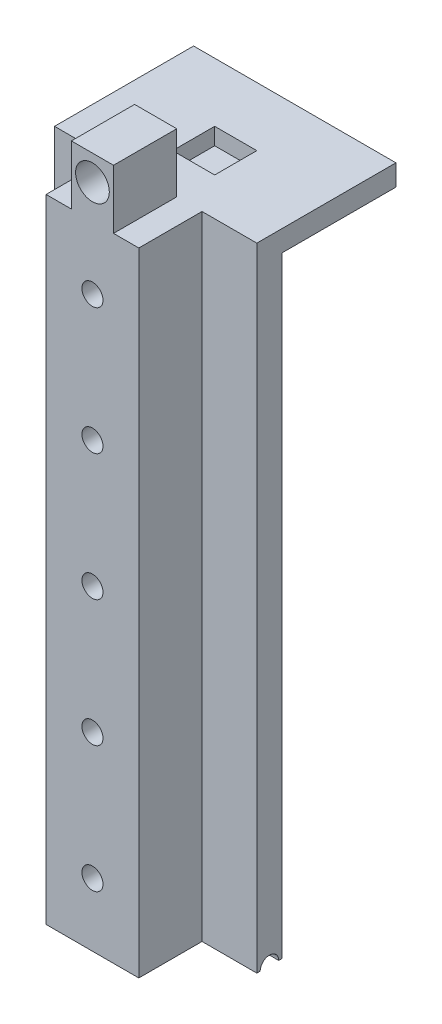
ISO-10303-21;
HEADER;
FILE_DESCRIPTION(('STEP AP214'),'2;1');
FILE_NAME('part.step','',(''),(''),'','','');
FILE_SCHEMA(('AUTOMOTIVE_DESIGN { 1 0 10303 214 1 1 1 1 }'));
ENDSEC;
DATA;
#1=APPLICATION_CONTEXT('core data for automotive mechanical design processes');
#2=APPLICATION_PROTOCOL_DEFINITION('international standard','automotive_design',2000,#1);
#3=PRODUCT_CONTEXT('',#1,'mechanical');
#4=PRODUCT('Part','Part','',(#3));
#5=PRODUCT_RELATED_PRODUCT_CATEGORY('part','',(#4));
#6=PRODUCT_DEFINITION_FORMATION('','',#4);
#7=PRODUCT_DEFINITION_CONTEXT('part definition',#1,'design');
#8=PRODUCT_DEFINITION('design','',#6,#7);
#9=PRODUCT_DEFINITION_SHAPE('','',#8);
#10=(LENGTH_UNIT() NAMED_UNIT(*) SI_UNIT(.MILLI.,.METRE.));
#11=(NAMED_UNIT(*) PLANE_ANGLE_UNIT() SI_UNIT($,.RADIAN.));
#12=(NAMED_UNIT(*) SI_UNIT($,.STERADIAN.) SOLID_ANGLE_UNIT());
#13=UNCERTAINTY_MEASURE_WITH_UNIT(LENGTH_MEASURE(1.E-05),#10,'distance_accuracy_value','');
#14=(GEOMETRIC_REPRESENTATION_CONTEXT(3) GLOBAL_UNCERTAINTY_ASSIGNED_CONTEXT((#13)) GLOBAL_UNIT_ASSIGNED_CONTEXT((#10,
#11,#12)) REPRESENTATION_CONTEXT('',''));
#15=CARTESIAN_POINT('',(0.,0.,0.));
#16=DIRECTION('',(0.,0.,1.));
#17=DIRECTION('',(1.,0.,0.));
#18=AXIS2_PLACEMENT_3D('',#15,#16,#17);
#19=CARTESIAN_POINT('',(11.6229500392828,23.9397751900583,3.));
#20=DIRECTION('',(0.,-1.,0.));
#21=DIRECTION('',(0.,0.,-1.));
#22=AXIS2_PLACEMENT_3D('',#19,#20,#21);
#23=PLANE('',#22);
#24=DIRECTION('',(-1.,0.,0.));
#25=VECTOR('',#24,1.);
#26=CARTESIAN_POINT('',(26.1229500392828,23.9397751900583,-6.5));
#27=LINE('',#26,#25);
#28=CARTESIAN_POINT('',(26.1229500392828,23.9397751900583,-6.5));
#29=VERTEX_POINT('',#28);
#30=CARTESIAN_POINT('',(21.1229500392828,23.9397751900583,-6.5));
#31=VERTEX_POINT('',#30);
#32=EDGE_CURVE('E246',#29,#31,#27,.T.);
#33=ORIENTED_EDGE('',*,*,#32,.F.);
#34=DIRECTION('',(0.,0.,-1.));
#35=VECTOR('',#34,1.);
#36=CARTESIAN_POINT('',(26.1229500392828,23.9397751900583,-1.5));
#37=LINE('',#36,#35);
#38=CARTESIAN_POINT('',(26.1229500392828,23.9397751900583,-1.5));
#39=VERTEX_POINT('',#38);
#40=EDGE_CURVE('E59',#39,#29,#37,.T.);
#41=ORIENTED_EDGE('',*,*,#40,.F.);
#42=DIRECTION('',(1.,0.,0.));
#43=VECTOR('',#42,1.);
#44=CARTESIAN_POINT('',(26.1229500392828,23.9397751900583,-1.5));
#45=LINE('',#44,#43);
#46=CARTESIAN_POINT('',(21.1229500392828,23.9397751900583,-1.5));
#47=VERTEX_POINT('',#46);
#48=EDGE_CURVE('E237',#47,#39,#45,.T.);
#49=ORIENTED_EDGE('',*,*,#48,.F.);
#50=DIRECTION('',(0.,0.,1.));
#51=VECTOR('',#50,1.);
#52=CARTESIAN_POINT('',(21.1229500392828,23.9397751900583,-1.5));
#53=LINE('',#52,#51);
#54=EDGE_CURVE('E240',#31,#47,#53,.T.);
#55=ORIENTED_EDGE('',*,*,#54,.F.);
#56=EDGE_LOOP('',(#33,#41,#49,#55));
#57=FACE_BOUND('',#56,.T.);
#58=DIRECTION('',(0.,0.,-1.));
#59=VECTOR('',#58,1.);
#60=CARTESIAN_POINT('',(26.1229500392828,23.9397751900583,10.5));
#61=LINE('',#60,#59);
#62=CARTESIAN_POINT('',(26.1229500392828,23.9397751900583,10.5));
#63=VERTEX_POINT('',#62);
#64=CARTESIAN_POINT('',(26.1229500392828,23.9397751900583,3.));
#65=VERTEX_POINT('',#64);
#66=EDGE_CURVE('E259',#63,#65,#61,.T.);
#67=ORIENTED_EDGE('',*,*,#66,.F.);
#68=DIRECTION('',(1.,0.,0.));
#69=VECTOR('',#68,1.);
#70=CARTESIAN_POINT('',(18.1229500392828,23.9397751900583,10.5));
#71=LINE('',#70,#69);
#72=CARTESIAN_POINT('',(29.1229500392828,23.9397751900583,10.5));
#73=VERTEX_POINT('',#72);
#74=EDGE_CURVE('E386',#63,#73,#71,.T.);
#75=ORIENTED_EDGE('',*,*,#74,.T.);
#76=DIRECTION('',(0.,0.,-1.));
#77=VECTOR('',#76,1.);
#78=CARTESIAN_POINT('',(29.1229500392828,23.9397751900583,10.5));
#79=LINE('',#78,#77);
#80=CARTESIAN_POINT('',(29.1229500392829,23.9397751900583,3.));
#81=VERTEX_POINT('',#80);
#82=EDGE_CURVE('E385',#73,#81,#79,.T.);
#83=ORIENTED_EDGE('',*,*,#82,.T.);
#84=DIRECTION('',(-1.,0.,0.));
#85=VECTOR('',#84,1.);
#86=CARTESIAN_POINT('',(11.6229500392828,23.9397751900583,3.));
#87=LINE('',#86,#85);
#88=CARTESIAN_POINT('',(35.6229500392828,23.9397751900583,3.));
#89=VERTEX_POINT('',#88);
#90=EDGE_CURVE('E369',#89,#81,#87,.T.);
#91=ORIENTED_EDGE('',*,*,#90,.F.);
#92=DIRECTION('',(0.,0.,-1.));
#93=VECTOR('',#92,1.);
#94=CARTESIAN_POINT('',(35.6229500392828,23.9397751900583,3.));
#95=LINE('',#94,#93);
#96=CARTESIAN_POINT('',(35.6229500392828,23.9397751900583,-13.5));
#97=VERTEX_POINT('',#96);
#98=EDGE_CURVE('E410',#89,#97,#95,.T.);
#99=ORIENTED_EDGE('',*,*,#98,.T.);
#100=DIRECTION('',(1.,0.,0.));
#101=VECTOR('',#100,1.);
#102=CARTESIAN_POINT('',(35.6229500392828,23.9397751900583,-13.5));
#103=LINE('',#102,#101);
#104=CARTESIAN_POINT('',(11.6229500392828,23.9397751900583,-13.5));
#105=VERTEX_POINT('',#104);
#106=EDGE_CURVE('E296',#105,#97,#103,.T.);
#107=ORIENTED_EDGE('',*,*,#106,.F.);
#108=DIRECTION('',(0.,0.,-1.));
#109=VECTOR('',#108,1.);
#110=CARTESIAN_POINT('',(11.6229500392828,23.9397751900583,3.));
#111=LINE('',#110,#109);
#112=CARTESIAN_POINT('',(11.6229500392828,23.9397751900583,3.));
#113=VERTEX_POINT('',#112);
#114=EDGE_CURVE('E418',#113,#105,#111,.T.);
#115=ORIENTED_EDGE('',*,*,#114,.F.);
#116=CARTESIAN_POINT('',(18.1229500392828,23.9397751900583,3.));
#117=VERTEX_POINT('',#116);
#118=EDGE_CURVE('E414',#117,#113,#87,.T.);
#119=ORIENTED_EDGE('',*,*,#118,.F.);
#120=DIRECTION('',(0.,0.,-1.));
#121=VECTOR('',#120,1.);
#122=CARTESIAN_POINT('',(18.1229500392828,23.9397751900583,10.5));
#123=LINE('',#122,#121);
#124=CARTESIAN_POINT('',(18.1229500392828,23.9397751900583,10.5));
#125=VERTEX_POINT('',#124);
#126=EDGE_CURVE('E391',#125,#117,#123,.T.);
#127=ORIENTED_EDGE('',*,*,#126,.F.);
#128=CARTESIAN_POINT('',(21.1229500392828,23.9397751900583,10.5));
#129=VERTEX_POINT('',#128);
#130=EDGE_CURVE('E383',#125,#129,#71,.T.);
#131=ORIENTED_EDGE('',*,*,#130,.T.);
#132=DIRECTION('',(0.,0.,1.));
#133=VECTOR('',#132,1.);
#134=CARTESIAN_POINT('',(21.1229500392828,23.9397751900583,10.5));
#135=LINE('',#134,#133);
#136=CARTESIAN_POINT('',(21.1229500392828,23.9397751900583,3.));
#137=VERTEX_POINT('',#136);
#138=EDGE_CURVE('E266',#137,#129,#135,.T.);
#139=ORIENTED_EDGE('',*,*,#138,.F.);
#140=DIRECTION('',(-1.,0.,0.));
#141=VECTOR('',#140,1.);
#142=CARTESIAN_POINT('',(26.1229500392828,23.9397751900583,3.));
#143=LINE('',#142,#141);
#144=EDGE_CURVE('E67',#65,#137,#143,.T.);
#145=ORIENTED_EDGE('',*,*,#144,.F.);
#146=EDGE_LOOP('',(#67,#75,#83,#91,#99,#107,#115,#119,#127,#131,#139,#145));
#147=FACE_BOUND('',#146,.T.);
#148=ADVANCED_FACE('F40',(#57,#147),#23,.F.);
#149=CARTESIAN_POINT('',(0.,0.,0.));
#150=DIRECTION('',(0.,0.,1.));
#151=DIRECTION('',(1.,0.,0.));
#152=AXIS2_PLACEMENT_3D('',#149,#150,#151);
#153=PLANE('',#152);
#154=DIRECTION('',(-1.,0.,0.));
#155=VECTOR('',#154,1.);
#156=CARTESIAN_POINT('',(35.6229500392829,21.4397751900583,0.));
#157=LINE('',#156,#155);
#158=CARTESIAN_POINT('',(35.6229500392828,21.4397751900583,0.));
#159=VERTEX_POINT('',#158);
#160=CARTESIAN_POINT('',(27.1229500392829,21.4397751900583,0.));
#161=VERTEX_POINT('',#160);
#162=EDGE_CURVE('E52',#159,#161,#157,.T.);
#163=ORIENTED_EDGE('',*,*,#162,.F.);
#164=DIRECTION('',(0.,1.,0.));
#165=VECTOR('',#164,1.);
#166=CARTESIAN_POINT('',(35.6229500392828,23.9397751900583,0.));
#167=LINE('',#166,#165);
#168=CARTESIAN_POINT('',(35.6229500392829,-51.0602248099417,0.));
#169=VERTEX_POINT('',#168);
#170=EDGE_CURVE('E425',#169,#159,#167,.T.);
#171=ORIENTED_EDGE('',*,*,#170,.F.);
#172=DIRECTION('',(1.,0.,0.));
#173=VECTOR('',#172,1.);
#174=CARTESIAN_POINT('',(11.6229500392829,-51.0602248099417,0.));
#175=LINE('',#174,#173);
#176=CARTESIAN_POINT('',(27.1229500392829,-51.0602248099417,0.));
#177=VERTEX_POINT('',#176);
#178=EDGE_CURVE('E322',#177,#169,#175,.T.);
#179=ORIENTED_EDGE('',*,*,#178,.F.);
#180=DIRECTION('',(0.,-1.,0.));
#181=VECTOR('',#180,1.);
#182=CARTESIAN_POINT('',(27.1229500392829,21.4397751900583,0.));
#183=LINE('',#182,#181);
#184=EDGE_CURVE('E346',#161,#177,#183,.T.);
#185=ORIENTED_EDGE('',*,*,#184,.F.);
#186=EDGE_LOOP('',(#163,#171,#179,#185));
#187=FACE_BOUND('',#186,.T.);
#188=ADVANCED_FACE('F455',(#187),#153,.F.);
#189=CARTESIAN_POINT('',(20.1229500392828,21.4397751900583,0.));
#190=VERTEX_POINT('',#189);
#191=CARTESIAN_POINT('',(11.6229500392828,21.4397751900583,0.));
#192=VERTEX_POINT('',#191);
#193=EDGE_CURVE('E12',#190,#192,#157,.T.);
#194=ORIENTED_EDGE('',*,*,#193,.F.);
#195=DIRECTION('',(0.,1.,0.));
#196=VECTOR('',#195,1.);
#197=CARTESIAN_POINT('',(20.1229500392828,-51.0602248099417,0.));
#198=LINE('',#197,#196);
#199=CARTESIAN_POINT('',(20.1229500392828,-51.0602248099417,0.));
#200=VERTEX_POINT('',#199);
#201=EDGE_CURVE('E310',#200,#190,#198,.T.);
#202=ORIENTED_EDGE('',*,*,#201,.F.);
#203=CARTESIAN_POINT('',(11.6229500392829,-51.0602248099417,0.));
#204=VERTEX_POINT('',#203);
#205=EDGE_CURVE('E382',#204,#200,#175,.T.);
#206=ORIENTED_EDGE('',*,*,#205,.F.);
#207=DIRECTION('',(0.,-1.,0.));
#208=VECTOR('',#207,1.);
#209=CARTESIAN_POINT('',(11.6229500392828,23.9397751900583,0.));
#210=LINE('',#209,#208);
#211=EDGE_CURVE('E420',#192,#204,#210,.T.);
#212=ORIENTED_EDGE('',*,*,#211,.F.);
#213=EDGE_LOOP('',(#194,#202,#206,#212));
#214=FACE_BOUND('',#213,.T.);
#215=ADVANCED_FACE('F533',(#214),#153,.F.);
#216=CARTESIAN_POINT('',(11.6229500392829,-51.0602248099417,3.));
#217=DIRECTION('',(0.,1.,0.));
#218=DIRECTION('',(0.,0.,1.));
#219=AXIS2_PLACEMENT_3D('',#216,#217,#218);
#220=PLANE('',#219);
#221=DIRECTION('',(1.,0.,0.));
#222=VECTOR('',#221,1.);
#223=CARTESIAN_POINT('',(27.1229500392829,-51.0602248099417,2.6));
#224=LINE('',#223,#222);
#225=CARTESIAN_POINT('',(27.1229500392829,-51.0602248099417,2.6));
#226=VERTEX_POINT('',#225);
#227=CARTESIAN_POINT('',(35.6229500392829,-51.0602248099417,2.6));
#228=VERTEX_POINT('',#227);
#229=EDGE_CURVE('E306',#226,#228,#224,.T.);
#230=ORIENTED_EDGE('',*,*,#229,.T.);
#231=DIRECTION('',(0.,0.,-1.));
#232=VECTOR('',#231,1.);
#233=CARTESIAN_POINT('',(35.6229500392829,-51.0602248099417,3.));
#234=LINE('',#233,#232);
#235=CARTESIAN_POINT('',(35.6229500392829,-51.0602248099417,3.));
#236=VERTEX_POINT('',#235);
#237=EDGE_CURVE('E428',#236,#228,#234,.T.);
#238=ORIENTED_EDGE('',*,*,#237,.F.);
#239=DIRECTION('',(1.,0.,0.));
#240=VECTOR('',#239,1.);
#241=CARTESIAN_POINT('',(11.6229500392829,-51.0602248099417,3.));
#242=LINE('',#241,#240);
#243=CARTESIAN_POINT('',(29.1229500392828,-51.0602248099417,3.));
#244=VERTEX_POINT('',#243);
#245=EDGE_CURVE('E397',#244,#236,#242,.T.);
#246=ORIENTED_EDGE('',*,*,#245,.F.);
#247=DIRECTION('',(0.,0.,-1.));
#248=VECTOR('',#247,1.);
#249=CARTESIAN_POINT('',(29.1229500392829,-51.0602248099417,10.5));
#250=LINE('',#249,#248);
#251=CARTESIAN_POINT('',(29.1229500392829,-51.0602248099417,10.5));
#252=VERTEX_POINT('',#251);
#253=EDGE_CURVE('E390',#252,#244,#250,.T.);
#254=ORIENTED_EDGE('',*,*,#253,.F.);
#255=DIRECTION('',(1.,0.,0.));
#256=VECTOR('',#255,1.);
#257=CARTESIAN_POINT('',(18.1229500392828,-51.0602248099417,10.5));
#258=LINE('',#257,#256);
#259=CARTESIAN_POINT('',(18.1229500392828,-51.0602248099417,10.5));
#260=VERTEX_POINT('',#259);
#261=EDGE_CURVE('E334',#260,#252,#258,.T.);
#262=ORIENTED_EDGE('',*,*,#261,.F.);
#263=DIRECTION('',(0.,0.,-1.));
#264=VECTOR('',#263,1.);
#265=CARTESIAN_POINT('',(18.1229500392828,-51.0602248099417,10.5));
#266=LINE('',#265,#264);
#267=CARTESIAN_POINT('',(18.1229500392828,-51.0602248099417,3.));
#268=VERTEX_POINT('',#267);
#269=EDGE_CURVE('E315',#260,#268,#266,.T.);
#270=ORIENTED_EDGE('',*,*,#269,.T.);
#271=CARTESIAN_POINT('',(11.6229500392829,-51.0602248099417,3.));
#272=VERTEX_POINT('',#271);
#273=EDGE_CURVE('E401',#272,#268,#242,.T.);
#274=ORIENTED_EDGE('',*,*,#273,.F.);
#275=DIRECTION('',(0.,0.,-1.));
#276=VECTOR('',#275,1.);
#277=CARTESIAN_POINT('',(11.6229500392829,-51.0602248099417,3.));
#278=LINE('',#277,#276);
#279=CARTESIAN_POINT('',(11.6229500392829,-51.0602248099417,2.6));
#280=VERTEX_POINT('',#279);
#281=EDGE_CURVE('E312',#272,#280,#278,.T.);
#282=ORIENTED_EDGE('',*,*,#281,.T.);
#283=DIRECTION('',(-1.,0.,0.));
#284=VECTOR('',#283,1.);
#285=CARTESIAN_POINT('',(20.1229500392828,-51.0602248099417,2.6));
#286=LINE('',#285,#284);
#287=CARTESIAN_POINT('',(20.1229500392828,-51.0602248099417,2.6));
#288=VERTEX_POINT('',#287);
#289=EDGE_CURVE('E309',#288,#280,#286,.T.);
#290=ORIENTED_EDGE('',*,*,#289,.F.);
#291=DIRECTION('',(0.,0.,-1.));
#292=VECTOR('',#291,1.);
#293=CARTESIAN_POINT('',(20.1229500392828,-51.0602248099417,6.));
#294=LINE('',#293,#292);
#295=CARTESIAN_POINT('',(20.1229500392828,-51.0602248099417,6.));
#296=VERTEX_POINT('',#295);
#297=EDGE_CURVE('E307',#296,#288,#294,.T.);
#298=ORIENTED_EDGE('',*,*,#297,.F.);
#299=DIRECTION('',(-1.,0.,0.));
#300=VECTOR('',#299,1.);
#301=CARTESIAN_POINT('',(27.1229500392829,-51.0602248099417,6.));
#302=LINE('',#301,#300);
#303=CARTESIAN_POINT('',(27.1229500392829,-51.0602248099417,6.));
#304=VERTEX_POINT('',#303);
#305=EDGE_CURVE('E330',#304,#296,#302,.T.);
#306=ORIENTED_EDGE('',*,*,#305,.F.);
#307=DIRECTION('',(0.,0.,-1.));
#308=VECTOR('',#307,1.);
#309=CARTESIAN_POINT('',(27.1229500392829,-51.0602248099417,6.));
#310=LINE('',#309,#308);
#311=EDGE_CURVE('E44',#304,#226,#310,.T.);
#312=ORIENTED_EDGE('',*,*,#311,.T.);
#313=EDGE_LOOP('',(#230,#238,#246,#254,#262,#270,#274,#282,#290,#298,#306,#312));
#314=FACE_BOUND('',#313,.T.);
#315=ADVANCED_FACE('F477',(#314),#220,.F.);
#316=DIRECTION('',(1.,0.,0.));
#317=VECTOR('',#316,1.);
#318=CARTESIAN_POINT('',(27.1229500392829,-51.0602248099417,0.4));
#319=LINE('',#318,#317);
#320=CARTESIAN_POINT('',(27.1229500392829,-51.0602248099417,0.4));
#321=VERTEX_POINT('',#320);
#322=CARTESIAN_POINT('',(35.6229500392829,-51.0602248099417,0.4));
#323=VERTEX_POINT('',#322);
#324=EDGE_CURVE('E325',#321,#323,#319,.T.);
#325=ORIENTED_EDGE('',*,*,#324,.F.);
#326=EDGE_CURVE('E452',#321,#177,#310,.T.);
#327=ORIENTED_EDGE('',*,*,#326,.T.);
#328=ORIENTED_EDGE('',*,*,#178,.T.);
#329=EDGE_CURVE('E422',#323,#169,#234,.T.);
#330=ORIENTED_EDGE('',*,*,#329,.F.);
#331=EDGE_LOOP('',(#325,#327,#328,#330));
#332=FACE_BOUND('',#331,.T.);
#333=ADVANCED_FACE('F451',(#332),#220,.F.);
#334=DIRECTION('',(-1.,0.,0.));
#335=VECTOR('',#334,1.);
#336=CARTESIAN_POINT('',(20.1229500392828,-51.0602248099417,0.4));
#337=LINE('',#336,#335);
#338=CARTESIAN_POINT('',(20.1229500392828,-51.0602248099417,0.4));
#339=VERTEX_POINT('',#338);
#340=CARTESIAN_POINT('',(11.6229500392829,-51.0602248099417,0.4));
#341=VERTEX_POINT('',#340);
#342=EDGE_CURVE('E320',#339,#341,#337,.T.);
#343=ORIENTED_EDGE('',*,*,#342,.T.);
#344=EDGE_CURVE('E316',#341,#204,#278,.T.);
#345=ORIENTED_EDGE('',*,*,#344,.T.);
#346=ORIENTED_EDGE('',*,*,#205,.T.);
#347=EDGE_CURVE('E311',#339,#200,#294,.T.);
#348=ORIENTED_EDGE('',*,*,#347,.F.);
#349=EDGE_LOOP('',(#343,#345,#346,#348));
#350=FACE_BOUND('',#349,.T.);
#351=ADVANCED_FACE('F531',(#350),#220,.F.);
#352=CARTESIAN_POINT('',(23.6229500392829,-43.5602248099417,10.5));
#353=DIRECTION('',(0.,0.,1.));
#354=DIRECTION('',(1.,0.,0.));
#355=AXIS2_PLACEMENT_3D('',#352,#353,#354);
#356=CYLINDRICAL_SURFACE('',#355,1.24999999999999);
#357=CARTESIAN_POINT('',(23.6229500392829,-43.5602248099417,10.5));
#358=DIRECTION('',(0.,0.,1.));
#359=DIRECTION('',(1.,0.,0.));
#360=AXIS2_PLACEMENT_3D('',#357,#358,#359);
#361=CIRCLE('',#360,1.24999999999999);
#362=CARTESIAN_POINT('',(24.8729500392828,-43.5602248099417,10.5));
#363=VERTEX_POINT('',#362);
#364=EDGE_CURVE('E379',#363,#363,#361,.T.);
#365=ORIENTED_EDGE('',*,*,#364,.T.);
#366=EDGE_LOOP('',(#365));
#367=FACE_BOUND('',#366,.T.);
#368=CARTESIAN_POINT('',(23.6229500392829,-43.5602248099417,6.));
#369=DIRECTION('',(0.,0.,-1.));
#370=DIRECTION('',(-1.,0.,0.));
#371=AXIS2_PLACEMENT_3D('',#368,#369,#370);
#372=CIRCLE('',#371,1.24999999999999);
#373=CARTESIAN_POINT('',(22.3729500392829,-43.5602248099417,6.));
#374=VERTEX_POINT('',#373);
#375=EDGE_CURVE('E363',#374,#374,#372,.F.);
#376=ORIENTED_EDGE('',*,*,#375,.F.);
#377=EDGE_LOOP('',(#376));
#378=FACE_BOUND('',#377,.T.);
#379=ADVANCED_FACE('F551',(#367,#378),#356,.F.);
#380=CARTESIAN_POINT('',(23.6229500392829,-28.5602248099417,10.5));
#381=DIRECTION('',(0.,0.,1.));
#382=DIRECTION('',(1.,0.,0.));
#383=AXIS2_PLACEMENT_3D('',#380,#381,#382);
#384=CYLINDRICAL_SURFACE('',#383,1.24999999999999);
#385=CARTESIAN_POINT('',(23.6229500392829,-28.5602248099417,10.5));
#386=DIRECTION('',(0.,0.,1.));
#387=DIRECTION('',(1.,0.,0.));
#388=AXIS2_PLACEMENT_3D('',#385,#386,#387);
#389=CIRCLE('',#388,1.24999999999999);
#390=CARTESIAN_POINT('',(24.8729500392828,-28.5602248099417,10.5));
#391=VERTEX_POINT('',#390);
#392=EDGE_CURVE('E376',#391,#391,#389,.T.);
#393=ORIENTED_EDGE('',*,*,#392,.T.);
#394=EDGE_LOOP('',(#393));
#395=FACE_BOUND('',#394,.T.);
#396=CARTESIAN_POINT('',(23.6229500392829,-28.5602248099417,6.));
#397=DIRECTION('',(0.,0.,-1.));
#398=DIRECTION('',(-1.,0.,0.));
#399=AXIS2_PLACEMENT_3D('',#396,#397,#398);
#400=CIRCLE('',#399,1.24999999999999);
#401=CARTESIAN_POINT('',(22.3729500392829,-28.5602248099417,6.));
#402=VERTEX_POINT('',#401);
#403=EDGE_CURVE('E360',#402,#402,#400,.F.);
#404=ORIENTED_EDGE('',*,*,#403,.F.);
#405=EDGE_LOOP('',(#404));
#406=FACE_BOUND('',#405,.T.);
#407=ADVANCED_FACE('F556',(#395,#406),#384,.F.);
#408=CARTESIAN_POINT('',(23.6229500392829,-13.5602248099417,10.5));
#409=DIRECTION('',(0.,0.,1.));
#410=DIRECTION('',(1.,0.,0.));
#411=AXIS2_PLACEMENT_3D('',#408,#409,#410);
#412=CYLINDRICAL_SURFACE('',#411,1.24999999999999);
#413=CARTESIAN_POINT('',(23.6229500392829,-13.5602248099417,10.5));
#414=DIRECTION('',(0.,0.,1.));
#415=DIRECTION('',(1.,0.,0.));
#416=AXIS2_PLACEMENT_3D('',#413,#414,#415);
#417=CIRCLE('',#416,1.24999999999999);
#418=CARTESIAN_POINT('',(24.8729500392828,-13.5602248099417,10.5));
#419=VERTEX_POINT('',#418);
#420=EDGE_CURVE('E373',#419,#419,#417,.T.);
#421=ORIENTED_EDGE('',*,*,#420,.T.);
#422=EDGE_LOOP('',(#421));
#423=FACE_BOUND('',#422,.T.);
#424=CARTESIAN_POINT('',(23.6229500392829,-13.5602248099417,6.));
#425=DIRECTION('',(0.,0.,-1.));
#426=DIRECTION('',(-1.,0.,0.));
#427=AXIS2_PLACEMENT_3D('',#424,#425,#426);
#428=CIRCLE('',#427,1.24999999999999);
#429=CARTESIAN_POINT('',(22.3729500392829,-13.5602248099417,6.));
#430=VERTEX_POINT('',#429);
#431=EDGE_CURVE('E357',#430,#430,#428,.F.);
#432=ORIENTED_EDGE('',*,*,#431,.F.);
#433=EDGE_LOOP('',(#432));
#434=FACE_BOUND('',#433,.T.);
#435=ADVANCED_FACE('F595',(#423,#434),#412,.F.);
#436=CARTESIAN_POINT('',(23.6229500392829,1.4397751900583,10.5));
#437=DIRECTION('',(0.,0.,1.));
#438=DIRECTION('',(1.,0.,0.));
#439=AXIS2_PLACEMENT_3D('',#436,#437,#438);
#440=CYLINDRICAL_SURFACE('',#439,1.24999999999999);
#441=CARTESIAN_POINT('',(23.6229500392829,1.4397751900583,10.5));
#442=DIRECTION('',(0.,0.,1.));
#443=DIRECTION('',(1.,0.,0.));
#444=AXIS2_PLACEMENT_3D('',#441,#442,#443);
#445=CIRCLE('',#444,1.24999999999999);
#446=CARTESIAN_POINT('',(24.8729500392828,1.4397751900583,10.5));
#447=VERTEX_POINT('',#446);
#448=EDGE_CURVE('E370',#447,#447,#445,.T.);
#449=ORIENTED_EDGE('',*,*,#448,.T.);
#450=EDGE_LOOP('',(#449));
#451=FACE_BOUND('',#450,.T.);
#452=CARTESIAN_POINT('',(23.6229500392829,1.4397751900583,6.));
#453=DIRECTION('',(0.,0.,-1.));
#454=DIRECTION('',(-1.,0.,0.));
#455=AXIS2_PLACEMENT_3D('',#452,#453,#454);
#456=CIRCLE('',#455,1.24999999999999);
#457=CARTESIAN_POINT('',(22.3729500392829,1.4397751900583,6.));
#458=VERTEX_POINT('',#457);
#459=EDGE_CURVE('E354',#458,#458,#456,.F.);
#460=ORIENTED_EDGE('',*,*,#459,.F.);
#461=EDGE_LOOP('',(#460));
#462=FACE_BOUND('',#461,.T.);
#463=ADVANCED_FACE('F605',(#451,#462),#440,.F.);
#464=CARTESIAN_POINT('',(23.6229500392828,16.4397751900583,10.5));
#465=DIRECTION('',(0.,0.,1.));
#466=DIRECTION('',(1.,0.,0.));
#467=AXIS2_PLACEMENT_3D('',#464,#465,#466);
#468=CYLINDRICAL_SURFACE('',#467,1.24999999999999);
#469=CARTESIAN_POINT('',(23.6229500392828,16.4397751900583,10.5));
#470=DIRECTION('',(0.,0.,1.));
#471=DIRECTION('',(1.,0.,0.));
#472=AXIS2_PLACEMENT_3D('',#469,#470,#471);
#473=CIRCLE('',#472,1.24999999999999);
#474=CARTESIAN_POINT('',(24.8729500392828,16.4397751900583,10.5));
#475=VERTEX_POINT('',#474);
#476=EDGE_CURVE('E366',#475,#475,#473,.T.);
#477=ORIENTED_EDGE('',*,*,#476,.T.);
#478=EDGE_LOOP('',(#477));
#479=FACE_BOUND('',#478,.T.);
#480=CARTESIAN_POINT('',(23.6229500392828,16.4397751900583,6.));
#481=DIRECTION('',(0.,0.,-1.));
#482=DIRECTION('',(-1.,0.,0.));
#483=AXIS2_PLACEMENT_3D('',#480,#481,#482);
#484=CIRCLE('',#483,1.24999999999999);
#485=CARTESIAN_POINT('',(22.3729500392829,16.4397751900583,6.));
#486=VERTEX_POINT('',#485);
#487=EDGE_CURVE('E343',#486,#486,#484,.F.);
#488=ORIENTED_EDGE('',*,*,#487,.F.);
#489=EDGE_LOOP('',(#488));
#490=FACE_BOUND('',#489,.T.);
#491=ADVANCED_FACE('F615',(#479,#490),#468,.F.);
#492=CARTESIAN_POINT('',(0.,0.,3.));
#493=DIRECTION('',(0.,0.,1.));
#494=DIRECTION('',(1.,0.,0.));
#495=AXIS2_PLACEMENT_3D('',#492,#493,#494);
#496=PLANE('',#495);
#497=ORIENTED_EDGE('',*,*,#90,.T.);
#498=DIRECTION('',(0.,-1.,0.));
#499=VECTOR('',#498,1.);
#500=CARTESIAN_POINT('',(29.1229500392828,23.9397751900583,3.));
#501=LINE('',#500,#499);
#502=EDGE_CURVE('E395',#81,#244,#501,.T.);
#503=ORIENTED_EDGE('',*,*,#502,.T.);
#504=ORIENTED_EDGE('',*,*,#245,.T.);
#505=DIRECTION('',(0.,1.,0.));
#506=VECTOR('',#505,1.);
#507=CARTESIAN_POINT('',(35.6229500392828,23.9397751900583,3.));
#508=LINE('',#507,#506);
#509=EDGE_CURVE('E416',#236,#89,#508,.T.);
#510=ORIENTED_EDGE('',*,*,#509,.T.);
#511=EDGE_LOOP('',(#497,#503,#504,#510));
#512=FACE_BOUND('',#511,.T.);
#513=ADVANCED_FACE('F473',(#512),#496,.T.);
#514=CARTESIAN_POINT('',(11.6229500392828,23.9397751900583,3.));
#515=DIRECTION('',(1.,0.,0.));
#516=DIRECTION('',(0.,1.,0.));
#517=AXIS2_PLACEMENT_3D('',#514,#515,#516);
#518=PLANE('',#517);
#519=CARTESIAN_POINT('',(11.6229500392829,-51.0602248099417,1.5));
#520=DIRECTION('',(-1.,0.,0.));
#521=DIRECTION('',(0.,0.,1.));
#522=AXIS2_PLACEMENT_3D('',#519,#520,#521);
#523=CIRCLE('',#522,1.1);
#524=EDGE_CURVE('E319',#280,#341,#523,.T.);
#525=ORIENTED_EDGE('',*,*,#524,.F.);
#526=ORIENTED_EDGE('',*,*,#281,.F.);
#527=DIRECTION('',(0.,-1.,0.));
#528=VECTOR('',#527,1.);
#529=CARTESIAN_POINT('',(11.6229500392828,23.9397751900583,3.));
#530=LINE('',#529,#528);
#531=EDGE_CURVE('E411',#113,#272,#530,.T.);
#532=ORIENTED_EDGE('',*,*,#531,.F.);
#533=ORIENTED_EDGE('',*,*,#114,.T.);
#534=DIRECTION('',(0.,1.,0.));
#535=VECTOR('',#534,1.);
#536=CARTESIAN_POINT('',(11.6229500392828,21.4397751900583,-13.5));
#537=LINE('',#536,#535);
#538=CARTESIAN_POINT('',(11.6229500392828,21.4397751900583,-13.5));
#539=VERTEX_POINT('',#538);
#540=EDGE_CURVE('E293',#539,#105,#537,.T.);
#541=ORIENTED_EDGE('',*,*,#540,.F.);
#542=DIRECTION('',(0.,0.,1.));
#543=VECTOR('',#542,1.);
#544=CARTESIAN_POINT('',(11.6229500392828,21.4397751900583,-13.5));
#545=LINE('',#544,#543);
#546=EDGE_CURVE('E298',#539,#192,#545,.T.);
#547=ORIENTED_EDGE('',*,*,#546,.T.);
#548=ORIENTED_EDGE('',*,*,#211,.T.);
#549=ORIENTED_EDGE('',*,*,#344,.F.);
#550=EDGE_LOOP('',(#525,#526,#532,#533,#541,#547,#548,#549));
#551=FACE_BOUND('',#550,.T.);
#552=ADVANCED_FACE('F497',(#551),#518,.F.);
#553=CARTESIAN_POINT('',(35.6229500392828,23.9397751900583,3.));
#554=DIRECTION('',(-1.,0.,0.));
#555=DIRECTION('',(0.,-1.,0.));
#556=AXIS2_PLACEMENT_3D('',#553,#554,#555);
#557=PLANE('',#556);
#558=CARTESIAN_POINT('',(35.6229500392829,-51.0602248099417,1.5));
#559=DIRECTION('',(1.,0.,0.));
#560=DIRECTION('',(0.,0.,-1.));
#561=AXIS2_PLACEMENT_3D('',#558,#559,#560);
#562=CIRCLE('',#561,1.1);
#563=EDGE_CURVE('E50',#323,#228,#562,.T.);
#564=ORIENTED_EDGE('',*,*,#563,.F.);
#565=ORIENTED_EDGE('',*,*,#329,.T.);
#566=ORIENTED_EDGE('',*,*,#170,.T.);
#567=DIRECTION('',(0.,0.,1.));
#568=VECTOR('',#567,1.);
#569=CARTESIAN_POINT('',(35.6229500392829,21.4397751900583,-13.5));
#570=LINE('',#569,#568);
#571=CARTESIAN_POINT('',(35.6229500392829,21.4397751900583,-13.5));
#572=VERTEX_POINT('',#571);
#573=EDGE_CURVE('E303',#572,#159,#570,.T.);
#574=ORIENTED_EDGE('',*,*,#573,.F.);
#575=DIRECTION('',(0.,-1.,0.));
#576=VECTOR('',#575,1.);
#577=CARTESIAN_POINT('',(35.6229500392829,21.4397751900583,-13.5));
#578=LINE('',#577,#576);
#579=EDGE_CURVE('E288',#97,#572,#578,.T.);
#580=ORIENTED_EDGE('',*,*,#579,.F.);
#581=ORIENTED_EDGE('',*,*,#98,.F.);
#582=ORIENTED_EDGE('',*,*,#509,.F.);
#583=ORIENTED_EDGE('',*,*,#237,.T.);
#584=EDGE_LOOP('',(#564,#565,#566,#574,#580,#581,#582,#583));
#585=FACE_BOUND('',#584,.T.);
#586=ADVANCED_FACE('F445',(#585),#557,.F.);
#587=DIRECTION('',(0.,-1.,0.));
#588=VECTOR('',#587,1.);
#589=CARTESIAN_POINT('',(18.1229500392828,23.9397751900583,3.));
#590=LINE('',#589,#588);
#591=EDGE_CURVE('E398',#117,#268,#590,.T.);
#592=ORIENTED_EDGE('',*,*,#591,.F.);
#593=ORIENTED_EDGE('',*,*,#118,.T.);
#594=ORIENTED_EDGE('',*,*,#531,.T.);
#595=ORIENTED_EDGE('',*,*,#273,.T.);
#596=EDGE_LOOP('',(#592,#593,#594,#595));
#597=FACE_BOUND('',#596,.T.);
#598=ADVANCED_FACE('F502',(#597),#496,.T.);
#599=CARTESIAN_POINT('',(18.1229500392828,23.9397751900583,10.5));
#600=DIRECTION('',(1.,0.,0.));
#601=DIRECTION('',(0.,1.,0.));
#602=AXIS2_PLACEMENT_3D('',#599,#600,#601);
#603=PLANE('',#602);
#604=ORIENTED_EDGE('',*,*,#591,.T.);
#605=ORIENTED_EDGE('',*,*,#269,.F.);
#606=DIRECTION('',(0.,-1.,0.));
#607=VECTOR('',#606,1.);
#608=CARTESIAN_POINT('',(18.1229500392828,23.9397751900583,10.5));
#609=LINE('',#608,#607);
#610=EDGE_CURVE('E393',#125,#260,#609,.T.);
#611=ORIENTED_EDGE('',*,*,#610,.F.);
#612=ORIENTED_EDGE('',*,*,#126,.T.);
#613=EDGE_LOOP('',(#604,#605,#611,#612));
#614=FACE_BOUND('',#613,.T.);
#615=ADVANCED_FACE('F505',(#614),#603,.F.);
#616=CARTESIAN_POINT('',(29.1229500392828,23.9397751900583,10.5));
#617=DIRECTION('',(1.,0.,0.));
#618=DIRECTION('',(0.,1.,0.));
#619=AXIS2_PLACEMENT_3D('',#616,#617,#618);
#620=PLANE('',#619);
#621=ORIENTED_EDGE('',*,*,#502,.F.);
#622=ORIENTED_EDGE('',*,*,#82,.F.);
#623=DIRECTION('',(0.,-1.,0.));
#624=VECTOR('',#623,1.);
#625=CARTESIAN_POINT('',(29.1229500392828,23.9397751900583,10.5));
#626=LINE('',#625,#624);
#627=EDGE_CURVE('E387',#73,#252,#626,.T.);
#628=ORIENTED_EDGE('',*,*,#627,.T.);
#629=ORIENTED_EDGE('',*,*,#253,.T.);
#630=EDGE_LOOP('',(#621,#622,#628,#629));
#631=FACE_BOUND('',#630,.T.);
#632=ADVANCED_FACE('F527',(#631),#620,.T.);
#633=CARTESIAN_POINT('',(0.,0.,10.5));
#634=DIRECTION('',(0.,0.,-1.));
#635=DIRECTION('',(-1.,0.,0.));
#636=AXIS2_PLACEMENT_3D('',#633,#634,#635);
#637=PLANE('',#636);
#638=CARTESIAN_POINT('',(23.6229500392828,27.9397751900583,10.5));
#639=DIRECTION('',(0.,0.,1.));
#640=DIRECTION('',(1.,0.,0.));
#641=AXIS2_PLACEMENT_3D('',#638,#639,#640);
#642=CIRCLE('',#641,2.);
#643=CARTESIAN_POINT('',(25.6229500392828,27.9397751900583,10.5));
#644=VERTEX_POINT('',#643);
#645=EDGE_CURVE('E252',#644,#644,#642,.T.);
#646=ORIENTED_EDGE('',*,*,#645,.F.);
#647=EDGE_LOOP('',(#646));
#648=FACE_BOUND('',#647,.T.);
#649=ORIENTED_EDGE('',*,*,#476,.F.);
#650=EDGE_LOOP('',(#649));
#651=FACE_BOUND('',#650,.T.);
#652=ORIENTED_EDGE('',*,*,#448,.F.);
#653=EDGE_LOOP('',(#652));
#654=FACE_BOUND('',#653,.T.);
#655=ORIENTED_EDGE('',*,*,#420,.F.);
#656=EDGE_LOOP('',(#655));
#657=FACE_BOUND('',#656,.T.);
#658=ORIENTED_EDGE('',*,*,#392,.F.);
#659=EDGE_LOOP('',(#658));
#660=FACE_BOUND('',#659,.T.);
#661=ORIENTED_EDGE('',*,*,#364,.F.);
#662=EDGE_LOOP('',(#661));
#663=FACE_BOUND('',#662,.T.);
#664=ORIENTED_EDGE('',*,*,#130,.F.);
#665=ORIENTED_EDGE('',*,*,#610,.T.);
#666=ORIENTED_EDGE('',*,*,#261,.T.);
#667=ORIENTED_EDGE('',*,*,#627,.F.);
#668=ORIENTED_EDGE('',*,*,#74,.F.);
#669=DIRECTION('',(0.,-1.,0.));
#670=VECTOR('',#669,1.);
#671=CARTESIAN_POINT('',(26.1229500392828,30.9397751900583,10.5));
#672=LINE('',#671,#670);
#673=CARTESIAN_POINT('',(26.1229500392828,30.9397751900583,10.5));
#674=VERTEX_POINT('',#673);
#675=EDGE_CURVE('E272',#674,#63,#672,.T.);
#676=ORIENTED_EDGE('',*,*,#675,.F.);
#677=DIRECTION('',(1.,0.,0.));
#678=VECTOR('',#677,1.);
#679=CARTESIAN_POINT('',(26.1229500392828,30.9397751900583,10.5));
#680=LINE('',#679,#678);
#681=CARTESIAN_POINT('',(21.1229500392828,30.9397751900583,10.5));
#682=VERTEX_POINT('',#681);
#683=EDGE_CURVE('E270',#682,#674,#680,.T.);
#684=ORIENTED_EDGE('',*,*,#683,.F.);
#685=DIRECTION('',(0.,-1.,0.));
#686=VECTOR('',#685,1.);
#687=CARTESIAN_POINT('',(21.1229500392828,30.9397751900583,10.5));
#688=LINE('',#687,#686);
#689=EDGE_CURVE('E280',#682,#129,#688,.T.);
#690=ORIENTED_EDGE('',*,*,#689,.T.);
#691=EDGE_LOOP('',(#664,#665,#666,#667,#668,#676,#684,#690));
#692=FACE_BOUND('',#691,.T.);
#693=ADVANCED_FACE('F510',(#648,#651,#654,#657,#660,#663,#692),#637,.F.);
#694=CARTESIAN_POINT('',(0.,0.,6.));
#695=DIRECTION('',(0.,0.,-1.));
#696=DIRECTION('',(-1.,0.,0.));
#697=AXIS2_PLACEMENT_3D('',#694,#695,#696);
#698=PLANE('',#697);
#699=ORIENTED_EDGE('',*,*,#305,.T.);
#700=DIRECTION('',(0.,1.,0.));
#701=VECTOR('',#700,1.);
#702=CARTESIAN_POINT('',(20.1229500392828,-51.0602248099417,6.));
#703=LINE('',#702,#701);
#704=CARTESIAN_POINT('',(20.1229500392828,21.4397751900583,6.));
#705=VERTEX_POINT('',#704);
#706=EDGE_CURVE('E333',#296,#705,#703,.T.);
#707=ORIENTED_EDGE('',*,*,#706,.T.);
#708=DIRECTION('',(1.,0.,0.));
#709=VECTOR('',#708,1.);
#710=CARTESIAN_POINT('',(20.1229500392828,21.4397751900583,6.));
#711=LINE('',#710,#709);
#712=CARTESIAN_POINT('',(27.1229500392829,21.4397751900583,6.));
#713=VERTEX_POINT('',#712);
#714=EDGE_CURVE('E337',#705,#713,#711,.T.);
#715=ORIENTED_EDGE('',*,*,#714,.T.);
#716=DIRECTION('',(0.,-1.,0.));
#717=VECTOR('',#716,1.);
#718=CARTESIAN_POINT('',(27.1229500392829,21.4397751900583,6.));
#719=LINE('',#718,#717);
#720=EDGE_CURVE('E340',#713,#304,#719,.T.);
#721=ORIENTED_EDGE('',*,*,#720,.T.);
#722=EDGE_LOOP('',(#699,#707,#715,#721));
#723=FACE_BOUND('',#722,.T.);
#724=ORIENTED_EDGE('',*,*,#487,.T.);
#725=EDGE_LOOP('',(#724));
#726=FACE_BOUND('',#725,.T.);
#727=ORIENTED_EDGE('',*,*,#459,.T.);
#728=EDGE_LOOP('',(#727));
#729=FACE_BOUND('',#728,.T.);
#730=ORIENTED_EDGE('',*,*,#431,.T.);
#731=EDGE_LOOP('',(#730));
#732=FACE_BOUND('',#731,.T.);
#733=ORIENTED_EDGE('',*,*,#403,.T.);
#734=EDGE_LOOP('',(#733));
#735=FACE_BOUND('',#734,.T.);
#736=ORIENTED_EDGE('',*,*,#375,.T.);
#737=EDGE_LOOP('',(#736));
#738=FACE_BOUND('',#737,.T.);
#739=ADVANCED_FACE('F486',(#723,#726,#729,#732,#735,#738),#698,.T.);
#740=CARTESIAN_POINT('',(27.1229500392829,21.4397751900583,6.));
#741=DIRECTION('',(1.,0.,0.));
#742=DIRECTION('',(0.,1.,0.));
#743=AXIS2_PLACEMENT_3D('',#740,#741,#742);
#744=PLANE('',#743);
#745=CARTESIAN_POINT('',(27.1229500392829,-51.0602248099417,1.5));
#746=DIRECTION('',(1.,0.,0.));
#747=DIRECTION('',(0.,0.,-1.));
#748=AXIS2_PLACEMENT_3D('',#745,#746,#747);
#749=CIRCLE('',#748,1.1);
#750=EDGE_CURVE('E351',#321,#226,#749,.T.);
#751=ORIENTED_EDGE('',*,*,#750,.T.);
#752=ORIENTED_EDGE('',*,*,#311,.F.);
#753=ORIENTED_EDGE('',*,*,#720,.F.);
#754=DIRECTION('',(0.,0.,-1.));
#755=VECTOR('',#754,1.);
#756=CARTESIAN_POINT('',(27.1229500392829,21.4397751900583,6.));
#757=LINE('',#756,#755);
#758=EDGE_CURVE('E349',#713,#161,#757,.T.);
#759=ORIENTED_EDGE('',*,*,#758,.T.);
#760=ORIENTED_EDGE('',*,*,#184,.T.);
#761=ORIENTED_EDGE('',*,*,#326,.F.);
#762=EDGE_LOOP('',(#751,#752,#753,#759,#760,#761));
#763=FACE_BOUND('',#762,.T.);
#764=ADVANCED_FACE('F483',(#763),#744,.F.);
#765=CARTESIAN_POINT('',(20.1229500392828,21.4397751900583,6.));
#766=DIRECTION('',(0.,1.,0.));
#767=DIRECTION('',(0.,0.,1.));
#768=AXIS2_PLACEMENT_3D('',#765,#766,#767);
#769=PLANE('',#768);
#770=DIRECTION('',(0.,0.,-1.));
#771=VECTOR('',#770,1.);
#772=CARTESIAN_POINT('',(20.1229500392828,21.4397751900583,6.));
#773=LINE('',#772,#771);
#774=EDGE_CURVE('E329',#705,#190,#773,.T.);
#775=ORIENTED_EDGE('',*,*,#774,.T.);
#776=ORIENTED_EDGE('',*,*,#193,.T.);
#777=ORIENTED_EDGE('',*,*,#546,.F.);
#778=DIRECTION('',(-1.,0.,0.));
#779=VECTOR('',#778,1.);
#780=CARTESIAN_POINT('',(35.6229500392829,21.4397751900583,-13.5));
#781=LINE('',#780,#779);
#782=EDGE_CURVE('E291',#572,#539,#781,.T.);
#783=ORIENTED_EDGE('',*,*,#782,.F.);
#784=ORIENTED_EDGE('',*,*,#573,.T.);
#785=ORIENTED_EDGE('',*,*,#162,.T.);
#786=ORIENTED_EDGE('',*,*,#758,.F.);
#787=ORIENTED_EDGE('',*,*,#714,.F.);
#788=EDGE_LOOP('',(#775,#776,#777,#783,#784,#785,#786,#787));
#789=FACE_BOUND('',#788,.T.);
#790=ADVANCED_FACE('F457',(#789),#769,.F.);
#791=CARTESIAN_POINT('',(20.1229500392828,-51.0602248099417,6.));
#792=DIRECTION('',(-1.,0.,0.));
#793=DIRECTION('',(0.,-1.,0.));
#794=AXIS2_PLACEMENT_3D('',#791,#792,#793);
#795=PLANE('',#794);
#796=CARTESIAN_POINT('',(20.1229500392828,-51.0602248099417,1.5));
#797=DIRECTION('',(-1.,0.,0.));
#798=DIRECTION('',(0.,0.,1.));
#799=AXIS2_PLACEMENT_3D('',#796,#797,#798);
#800=CIRCLE('',#799,1.1);
#801=EDGE_CURVE('E326',#288,#339,#800,.T.);
#802=ORIENTED_EDGE('',*,*,#801,.T.);
#803=ORIENTED_EDGE('',*,*,#347,.T.);
#804=ORIENTED_EDGE('',*,*,#201,.T.);
#805=ORIENTED_EDGE('',*,*,#774,.F.);
#806=ORIENTED_EDGE('',*,*,#706,.F.);
#807=ORIENTED_EDGE('',*,*,#297,.T.);
#808=EDGE_LOOP('',(#802,#803,#804,#805,#806,#807));
#809=FACE_BOUND('',#808,.T.);
#810=ADVANCED_FACE('F492',(#809),#795,.F.);
#811=CARTESIAN_POINT('',(20.1229500392828,-51.0602248099417,1.5));
#812=DIRECTION('',(-1.,0.,0.));
#813=DIRECTION('',(0.,0.,1.));
#814=AXIS2_PLACEMENT_3D('',#811,#812,#813);
#815=CYLINDRICAL_SURFACE('',#814,1.1);
#816=ORIENTED_EDGE('',*,*,#342,.F.);
#817=ORIENTED_EDGE('',*,*,#801,.F.);
#818=ORIENTED_EDGE('',*,*,#289,.T.);
#819=ORIENTED_EDGE('',*,*,#524,.T.);
#820=EDGE_LOOP('',(#816,#817,#818,#819));
#821=FACE_BOUND('',#820,.T.);
#822=ADVANCED_FACE('F529',(#821),#815,.F.);
#823=CARTESIAN_POINT('',(27.1229500392829,-51.0602248099417,1.5));
#824=DIRECTION('',(1.,0.,0.));
#825=DIRECTION('',(0.,0.,-1.));
#826=AXIS2_PLACEMENT_3D('',#823,#824,#825);
#827=CYLINDRICAL_SURFACE('',#826,1.1);
#828=ORIENTED_EDGE('',*,*,#229,.F.);
#829=ORIENTED_EDGE('',*,*,#750,.F.);
#830=ORIENTED_EDGE('',*,*,#324,.T.);
#831=ORIENTED_EDGE('',*,*,#563,.T.);
#832=EDGE_LOOP('',(#828,#829,#830,#831));
#833=FACE_BOUND('',#832,.T.);
#834=ADVANCED_FACE('F42',(#833),#827,.F.);
#835=CARTESIAN_POINT('',(0.,0.,-13.5));
#836=DIRECTION('',(0.,0.,1.));
#837=DIRECTION('',(1.,0.,0.));
#838=AXIS2_PLACEMENT_3D('',#835,#836,#837);
#839=PLANE('',#838);
#840=ORIENTED_EDGE('',*,*,#579,.T.);
#841=ORIENTED_EDGE('',*,*,#782,.T.);
#842=ORIENTED_EDGE('',*,*,#540,.T.);
#843=ORIENTED_EDGE('',*,*,#106,.T.);
#844=EDGE_LOOP('',(#840,#841,#842,#843));
#845=FACE_BOUND('',#844,.T.);
#846=ADVANCED_FACE('F464',(#845),#839,.F.);
#847=CARTESIAN_POINT('',(26.1229500392828,30.9397751900583,10.5));
#848=DIRECTION('',(-1.,0.,0.));
#849=DIRECTION('',(0.,0.,1.));
#850=AXIS2_PLACEMENT_3D('',#847,#848,#849);
#851=PLANE('',#850);
#852=ORIENTED_EDGE('',*,*,#66,.T.);
#853=DIRECTION('',(0.,-1.,0.));
#854=VECTOR('',#853,1.);
#855=CARTESIAN_POINT('',(26.1229500392828,30.9397751900583,3.));
#856=LINE('',#855,#854);
#857=CARTESIAN_POINT('',(26.1229500392828,30.9397751900583,3.));
#858=VERTEX_POINT('',#857);
#859=EDGE_CURVE('E286',#858,#65,#856,.T.);
#860=ORIENTED_EDGE('',*,*,#859,.F.);
#861=DIRECTION('',(0.,0.,-1.));
#862=VECTOR('',#861,1.);
#863=CARTESIAN_POINT('',(26.1229500392828,30.9397751900583,10.5));
#864=LINE('',#863,#862);
#865=EDGE_CURVE('E262',#674,#858,#864,.T.);
#866=ORIENTED_EDGE('',*,*,#865,.F.);
#867=ORIENTED_EDGE('',*,*,#675,.T.);
#868=EDGE_LOOP('',(#852,#860,#866,#867));
#869=FACE_BOUND('',#868,.T.);
#870=ADVANCED_FACE('F522',(#869),#851,.F.);
#871=CARTESIAN_POINT('',(26.1229500392828,30.9397751900583,3.));
#872=DIRECTION('',(0.,0.,1.));
#873=DIRECTION('',(1.,0.,0.));
#874=AXIS2_PLACEMENT_3D('',#871,#872,#873);
#875=PLANE('',#874);
#876=CARTESIAN_POINT('',(23.6229500392828,27.9397751900583,3.));
#877=DIRECTION('',(0.,0.,1.));
#878=DIRECTION('',(1.,0.,0.));
#879=AXIS2_PLACEMENT_3D('',#876,#877,#878);
#880=CIRCLE('',#879,2.);
#881=CARTESIAN_POINT('',(25.6229500392828,27.9397751900583,3.));
#882=VERTEX_POINT('',#881);
#883=EDGE_CURVE('E256',#882,#882,#880,.T.);
#884=ORIENTED_EDGE('',*,*,#883,.T.);
#885=EDGE_LOOP('',(#884));
#886=FACE_BOUND('',#885,.T.);
#887=ORIENTED_EDGE('',*,*,#144,.T.);
#888=DIRECTION('',(0.,-1.,0.));
#889=VECTOR('',#888,1.);
#890=CARTESIAN_POINT('',(21.1229500392828,30.9397751900583,3.));
#891=LINE('',#890,#889);
#892=CARTESIAN_POINT('',(21.1229500392828,30.9397751900583,3.));
#893=VERTEX_POINT('',#892);
#894=EDGE_CURVE('E283',#893,#137,#891,.T.);
#895=ORIENTED_EDGE('',*,*,#894,.F.);
#896=DIRECTION('',(-1.,0.,0.));
#897=VECTOR('',#896,1.);
#898=CARTESIAN_POINT('',(26.1229500392828,30.9397751900583,3.));
#899=LINE('',#898,#897);
#900=EDGE_CURVE('E265',#858,#893,#899,.T.);
#901=ORIENTED_EDGE('',*,*,#900,.F.);
#902=ORIENTED_EDGE('',*,*,#859,.T.);
#903=EDGE_LOOP('',(#887,#895,#901,#902));
#904=FACE_BOUND('',#903,.T.);
#905=ADVANCED_FACE('F518',(#886,#904),#875,.F.);
#906=CARTESIAN_POINT('',(21.1229500392828,30.9397751900583,10.5));
#907=DIRECTION('',(1.,0.,0.));
#908=DIRECTION('',(0.,0.,-1.));
#909=AXIS2_PLACEMENT_3D('',#906,#907,#908);
#910=PLANE('',#909);
#911=ORIENTED_EDGE('',*,*,#138,.T.);
#912=ORIENTED_EDGE('',*,*,#689,.F.);
#913=DIRECTION('',(0.,0.,1.));
#914=VECTOR('',#913,1.);
#915=CARTESIAN_POINT('',(21.1229500392828,30.9397751900583,10.5));
#916=LINE('',#915,#914);
#917=EDGE_CURVE('E268',#893,#682,#916,.T.);
#918=ORIENTED_EDGE('',*,*,#917,.F.);
#919=ORIENTED_EDGE('',*,*,#894,.T.);
#920=EDGE_LOOP('',(#911,#912,#918,#919));
#921=FACE_BOUND('',#920,.T.);
#922=ADVANCED_FACE('F514',(#921),#910,.F.);
#923=CARTESIAN_POINT('',(0.,30.9397751900583,0.));
#924=DIRECTION('',(0.,1.,0.));
#925=DIRECTION('',(0.,0.,1.));
#926=AXIS2_PLACEMENT_3D('',#923,#924,#925);
#927=PLANE('',#926);
#928=ORIENTED_EDGE('',*,*,#865,.T.);
#929=ORIENTED_EDGE('',*,*,#900,.T.);
#930=ORIENTED_EDGE('',*,*,#917,.T.);
#931=ORIENTED_EDGE('',*,*,#683,.T.);
#932=EDGE_LOOP('',(#928,#929,#930,#931));
#933=FACE_BOUND('',#932,.T.);
#934=ADVANCED_FACE('F758',(#933),#927,.T.);
#935=CARTESIAN_POINT('',(23.6229500392828,27.9397751900583,3.));
#936=DIRECTION('',(0.,0.,1.));
#937=DIRECTION('',(1.,0.,0.));
#938=AXIS2_PLACEMENT_3D('',#935,#936,#937);
#939=CYLINDRICAL_SURFACE('',#938,2.);
#940=ORIENTED_EDGE('',*,*,#883,.F.);
#941=EDGE_LOOP('',(#940));
#942=FACE_BOUND('',#941,.T.);
#943=ORIENTED_EDGE('',*,*,#645,.T.);
#944=EDGE_LOOP('',(#943));
#945=FACE_BOUND('',#944,.T.);
#946=ADVANCED_FACE('F767',(#942,#945),#939,.F.);
#947=CARTESIAN_POINT('',(26.1229500392828,21.9397751900583,-1.5));
#948=DIRECTION('',(1.,0.,0.));
#949=DIRECTION('',(0.,0.,-1.));
#950=AXIS2_PLACEMENT_3D('',#947,#948,#949);
#951=PLANE('',#950);
#952=ORIENTED_EDGE('',*,*,#40,.T.);
#953=DIRECTION('',(0.,1.,0.));
#954=VECTOR('',#953,1.);
#955=CARTESIAN_POINT('',(26.1229500392828,21.9397751900583,-6.5));
#956=LINE('',#955,#954);
#957=CARTESIAN_POINT('',(26.1229500392828,21.9397751900583,-6.5));
#958=VERTEX_POINT('',#957);
#959=EDGE_CURVE('E215',#958,#29,#956,.T.);
#960=ORIENTED_EDGE('',*,*,#959,.F.);
#961=DIRECTION('',(0.,0.,-1.));
#962=VECTOR('',#961,1.);
#963=CARTESIAN_POINT('',(26.1229500392828,21.9397751900583,-1.5));
#964=LINE('',#963,#962);
#965=CARTESIAN_POINT('',(26.1229500392828,21.9397751900583,-1.5));
#966=VERTEX_POINT('',#965);
#967=EDGE_CURVE('E219',#966,#958,#964,.T.);
#968=ORIENTED_EDGE('',*,*,#967,.F.);
#969=DIRECTION('',(0.,1.,0.));
#970=VECTOR('',#969,1.);
#971=CARTESIAN_POINT('',(26.1229500392828,21.9397751900583,-1.5));
#972=LINE('',#971,#970);
#973=EDGE_CURVE('E250',#966,#39,#972,.T.);
#974=ORIENTED_EDGE('',*,*,#973,.T.);
#975=EDGE_LOOP('',(#952,#960,#968,#974));
#976=FACE_BOUND('',#975,.T.);
#977=ADVANCED_FACE('F217',(#976),#951,.F.);
#978=CARTESIAN_POINT('',(26.1229500392828,21.9397751900583,-1.5));
#979=DIRECTION('',(0.,0.,1.));
#980=DIRECTION('',(1.,0.,0.));
#981=AXIS2_PLACEMENT_3D('',#978,#979,#980);
#982=PLANE('',#981);
#983=ORIENTED_EDGE('',*,*,#48,.T.);
#984=ORIENTED_EDGE('',*,*,#973,.F.);
#985=DIRECTION('',(1.,0.,0.));
#986=VECTOR('',#985,1.);
#987=CARTESIAN_POINT('',(26.1229500392828,21.9397751900583,-1.5));
#988=LINE('',#987,#986);
#989=CARTESIAN_POINT('',(21.1229500392828,21.9397751900583,-1.5));
#990=VERTEX_POINT('',#989);
#991=EDGE_CURVE('E225',#990,#966,#988,.T.);
#992=ORIENTED_EDGE('',*,*,#991,.F.);
#993=DIRECTION('',(0.,1.,0.));
#994=VECTOR('',#993,1.);
#995=CARTESIAN_POINT('',(21.1229500392828,21.9397751900583,-1.5));
#996=LINE('',#995,#994);
#997=EDGE_CURVE('E253',#990,#47,#996,.T.);
#998=ORIENTED_EDGE('',*,*,#997,.T.);
#999=EDGE_LOOP('',(#983,#984,#992,#998));
#1000=FACE_BOUND('',#999,.T.);
#1001=ADVANCED_FACE('F805',(#1000),#982,.F.);
#1002=CARTESIAN_POINT('',(21.1229500392828,21.9397751900583,-1.5));
#1003=DIRECTION('',(-1.,0.,0.));
#1004=DIRECTION('',(0.,0.,1.));
#1005=AXIS2_PLACEMENT_3D('',#1002,#1003,#1004);
#1006=PLANE('',#1005);
#1007=ORIENTED_EDGE('',*,*,#54,.T.);
#1008=ORIENTED_EDGE('',*,*,#997,.F.);
#1009=DIRECTION('',(0.,0.,1.));
#1010=VECTOR('',#1009,1.);
#1011=CARTESIAN_POINT('',(21.1229500392828,21.9397751900583,-1.5));
#1012=LINE('',#1011,#1010);
#1013=CARTESIAN_POINT('',(21.1229500392828,21.9397751900583,-6.5));
#1014=VERTEX_POINT('',#1013);
#1015=EDGE_CURVE('E233',#1014,#990,#1012,.T.);
#1016=ORIENTED_EDGE('',*,*,#1015,.F.);
#1017=DIRECTION('',(0.,1.,0.));
#1018=VECTOR('',#1017,1.);
#1019=CARTESIAN_POINT('',(21.1229500392828,21.9397751900583,-6.5));
#1020=LINE('',#1019,#1018);
#1021=EDGE_CURVE('E224',#1014,#31,#1020,.T.);
#1022=ORIENTED_EDGE('',*,*,#1021,.T.);
#1023=EDGE_LOOP('',(#1007,#1008,#1016,#1022));
#1024=FACE_BOUND('',#1023,.T.);
#1025=ADVANCED_FACE('F814',(#1024),#1006,.F.);
#1026=CARTESIAN_POINT('',(26.1229500392828,21.9397751900583,-6.5));
#1027=DIRECTION('',(0.,0.,-1.));
#1028=DIRECTION('',(-1.,0.,0.));
#1029=AXIS2_PLACEMENT_3D('',#1026,#1027,#1028);
#1030=PLANE('',#1029);
#1031=ORIENTED_EDGE('',*,*,#32,.T.);
#1032=ORIENTED_EDGE('',*,*,#1021,.F.);
#1033=DIRECTION('',(-1.,0.,0.));
#1034=VECTOR('',#1033,1.);
#1035=CARTESIAN_POINT('',(26.1229500392828,21.9397751900583,-6.5));
#1036=LINE('',#1035,#1034);
#1037=EDGE_CURVE('E228',#958,#1014,#1036,.T.);
#1038=ORIENTED_EDGE('',*,*,#1037,.F.);
#1039=ORIENTED_EDGE('',*,*,#959,.T.);
#1040=EDGE_LOOP('',(#1031,#1032,#1038,#1039));
#1041=FACE_BOUND('',#1040,.T.);
#1042=ADVANCED_FACE('F229',(#1041),#1030,.F.);
#1043=CARTESIAN_POINT('',(0.,21.9397751900583,0.));
#1044=DIRECTION('',(0.,1.,0.));
#1045=DIRECTION('',(0.,0.,1.));
#1046=AXIS2_PLACEMENT_3D('',#1043,#1044,#1045);
#1047=PLANE('',#1046);
#1048=ORIENTED_EDGE('',*,*,#967,.T.);
#1049=ORIENTED_EDGE('',*,*,#1037,.T.);
#1050=ORIENTED_EDGE('',*,*,#1015,.T.);
#1051=ORIENTED_EDGE('',*,*,#991,.T.);
#1052=EDGE_LOOP('',(#1048,#1049,#1050,#1051));
#1053=FACE_BOUND('',#1052,.T.);
#1054=ADVANCED_FACE('F235',(#1053),#1047,.T.);
#1055=CLOSED_SHELL('',(#148,#188,#215,#315,#333,#351,#379,#407,#435,#463,#491,#513,#552,#586,
#598,#615,#632,#693,#739,#764,#790,#810,#822,#834,#846,#870,#905,#922,#934,#946,#977,#1001,
#1025,#1042,#1054));
#1056=MANIFOLD_SOLID_BREP('B2',#1055);
#1057=ADVANCED_BREP_SHAPE_REPRESENTATION('',(#18,#1056),#14);
#1058=SHAPE_DEFINITION_REPRESENTATION(#9,#1057);
ENDSEC;
END-ISO-10303-21;
